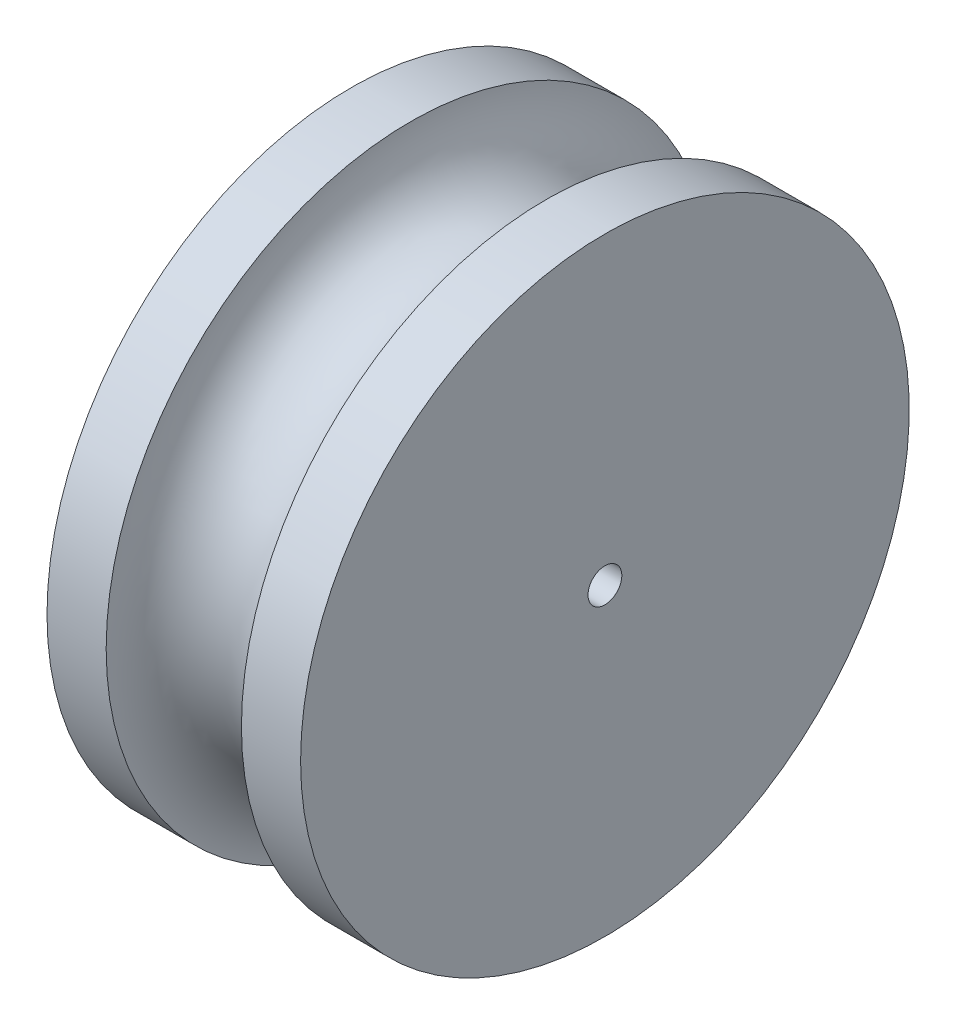
ISO-10303-21;
HEADER;
FILE_DESCRIPTION(('STEP AP214'),'2;1');
FILE_NAME('part.step','',(''),(''),'','','');
FILE_SCHEMA(('AUTOMOTIVE_DESIGN { 1 0 10303 214 1 1 1 1 }'));
ENDSEC;
DATA;
#1=APPLICATION_CONTEXT('core data for automotive mechanical design processes');
#2=APPLICATION_PROTOCOL_DEFINITION('international standard','automotive_design',2000,#1);
#3=PRODUCT_CONTEXT('',#1,'mechanical');
#4=PRODUCT('Part','Part','',(#3));
#5=PRODUCT_RELATED_PRODUCT_CATEGORY('part','',(#4));
#6=PRODUCT_DEFINITION_FORMATION('','',#4);
#7=PRODUCT_DEFINITION_CONTEXT('part definition',#1,'design');
#8=PRODUCT_DEFINITION('design','',#6,#7);
#9=PRODUCT_DEFINITION_SHAPE('','',#8);
#10=(LENGTH_UNIT() NAMED_UNIT(*) SI_UNIT(.MILLI.,.METRE.));
#11=(NAMED_UNIT(*) PLANE_ANGLE_UNIT() SI_UNIT($,.RADIAN.));
#12=(NAMED_UNIT(*) SI_UNIT($,.STERADIAN.) SOLID_ANGLE_UNIT());
#13=UNCERTAINTY_MEASURE_WITH_UNIT(LENGTH_MEASURE(1.E-05),#10,'distance_accuracy_value','');
#14=(GEOMETRIC_REPRESENTATION_CONTEXT(3) GLOBAL_UNCERTAINTY_ASSIGNED_CONTEXT((#13)) GLOBAL_UNIT_ASSIGNED_CONTEXT((#10,
#11,#12)) REPRESENTATION_CONTEXT('',''));
#15=CARTESIAN_POINT('',(0.,0.,0.));
#16=DIRECTION('',(0.,0.,1.));
#17=DIRECTION('',(1.,0.,0.));
#18=AXIS2_PLACEMENT_3D('',#15,#16,#17);
#19=CARTESIAN_POINT('',(-3583.58955329185,0.,0.));
#20=DIRECTION('',(-1.,0.,0.));
#21=DIRECTION('',(0.,0.,1.));
#22=AXIS2_PLACEMENT_3D('',#19,#20,#21);
#23=CYLINDRICAL_SURFACE('',#22,228.6);
#24=CARTESIAN_POINT('',(-95.2500000000001,0.,0.));
#25=DIRECTION('',(-1.,0.,0.));
#26=DIRECTION('',(0.,0.,1.));
#27=AXIS2_PLACEMENT_3D('',#24,#25,#26);
#28=CIRCLE('',#27,228.6);
#29=CARTESIAN_POINT('',(-95.2500000000001,0.,228.6));
#30=VERTEX_POINT('',#29);
#31=EDGE_CURVE('E10',#30,#30,#28,.T.);
#32=ORIENTED_EDGE('',*,*,#31,.F.);
#33=EDGE_LOOP('',(#32));
#34=FACE_BOUND('',#33,.T.);
#35=CARTESIAN_POINT('',(-50.7999999999993,0.,0.));
#36=DIRECTION('',(-1.,0.,0.));
#37=DIRECTION('',(0.,0.,1.));
#38=AXIS2_PLACEMENT_3D('',#35,#36,#37);
#39=CIRCLE('',#38,228.6);
#40=CARTESIAN_POINT('',(-50.7999999999993,0.,228.6));
#41=VERTEX_POINT('',#40);
#42=EDGE_CURVE('E68',#41,#41,#39,.T.);
#43=ORIENTED_EDGE('',*,*,#42,.T.);
#44=EDGE_LOOP('',(#43));
#45=FACE_BOUND('',#44,.T.);
#46=ADVANCED_FACE('F41',(#34,#45),#23,.T.);
#47=CARTESIAN_POINT('',(-95.25,0.,-12.7));
#48=DIRECTION('',(1.,0.,0.));
#49=DIRECTION('',(0.,0.,-1.));
#50=AXIS2_PLACEMENT_3D('',#47,#48,#49);
#51=PLANE('',#50);
#52=CARTESIAN_POINT('',(-95.2500000000001,0.,0.));
#53=DIRECTION('',(-1.,0.,0.));
#54=DIRECTION('',(0.,0.,1.));
#55=AXIS2_PLACEMENT_3D('',#52,#53,#54);
#56=CIRCLE('',#55,12.7);
#57=CARTESIAN_POINT('',(-95.2500000000001,0.,12.7));
#58=VERTEX_POINT('',#57);
#59=EDGE_CURVE('E48',#58,#58,#56,.T.);
#60=ORIENTED_EDGE('',*,*,#59,.F.);
#61=EDGE_LOOP('',(#60));
#62=FACE_BOUND('',#61,.T.);
#63=ORIENTED_EDGE('',*,*,#31,.T.);
#64=EDGE_LOOP('',(#63));
#65=FACE_BOUND('',#64,.T.);
#66=ADVANCED_FACE('F94',(#62,#65),#51,.F.);
#67=CARTESIAN_POINT('',(-3583.58955329185,0.,0.));
#68=DIRECTION('',(-1.,0.,0.));
#69=DIRECTION('',(0.,0.,1.));
#70=AXIS2_PLACEMENT_3D('',#67,#68,#69);
#71=CYLINDRICAL_SURFACE('',#70,12.7);
#72=CARTESIAN_POINT('',(95.2500000000001,0.,0.));
#73=DIRECTION('',(-1.,0.,0.));
#74=DIRECTION('',(0.,0.,1.));
#75=AXIS2_PLACEMENT_3D('',#72,#73,#74);
#76=CIRCLE('',#75,12.7);
#77=CARTESIAN_POINT('',(95.2500000000001,0.,12.7));
#78=VERTEX_POINT('',#77);
#79=EDGE_CURVE('E53',#78,#78,#76,.T.);
#80=ORIENTED_EDGE('',*,*,#79,.F.);
#81=EDGE_LOOP('',(#80));
#82=FACE_BOUND('',#81,.T.);
#83=ORIENTED_EDGE('',*,*,#59,.T.);
#84=EDGE_LOOP('',(#83));
#85=FACE_BOUND('',#84,.T.);
#86=ADVANCED_FACE('F89',(#82,#85),#71,.F.);
#87=CARTESIAN_POINT('',(95.2499999999992,0.,-12.7));
#88=DIRECTION('',(-1.,0.,0.));
#89=DIRECTION('',(0.,0.,1.));
#90=AXIS2_PLACEMENT_3D('',#87,#88,#89);
#91=PLANE('',#90);
#92=CARTESIAN_POINT('',(95.2499999999983,0.,0.));
#93=DIRECTION('',(-1.,0.,0.));
#94=DIRECTION('',(0.,0.,1.));
#95=AXIS2_PLACEMENT_3D('',#92,#93,#94);
#96=CIRCLE('',#95,228.600000000001);
#97=CARTESIAN_POINT('',(95.2499999999983,0.,228.600000000001));
#98=VERTEX_POINT('',#97);
#99=EDGE_CURVE('E58',#98,#98,#96,.T.);
#100=ORIENTED_EDGE('',*,*,#99,.F.);
#101=EDGE_LOOP('',(#100));
#102=FACE_BOUND('',#101,.T.);
#103=ORIENTED_EDGE('',*,*,#79,.T.);
#104=EDGE_LOOP('',(#103));
#105=FACE_BOUND('',#104,.T.);
#106=ADVANCED_FACE('F83',(#102,#105),#91,.F.);
#107=CARTESIAN_POINT('',(-3583.58955329185,0.,0.));
#108=DIRECTION('',(-1.,0.,0.));
#109=DIRECTION('',(0.,0.,1.));
#110=AXIS2_PLACEMENT_3D('',#107,#108,#109);
#111=CYLINDRICAL_SURFACE('',#110,228.6);
#112=CARTESIAN_POINT('',(50.7999999999984,0.,0.));
#113=DIRECTION('',(-1.,0.,0.));
#114=DIRECTION('',(0.,0.,1.));
#115=AXIS2_PLACEMENT_3D('',#112,#113,#114);
#116=CIRCLE('',#115,228.6);
#117=CARTESIAN_POINT('',(50.7999999999984,0.,228.6));
#118=VERTEX_POINT('',#117);
#119=EDGE_CURVE('E64',#118,#118,#116,.T.);
#120=ORIENTED_EDGE('',*,*,#119,.F.);
#121=EDGE_LOOP('',(#120));
#122=FACE_BOUND('',#121,.T.);
#123=ORIENTED_EDGE('',*,*,#99,.T.);
#124=EDGE_LOOP('',(#123));
#125=FACE_BOUND('',#124,.T.);
#126=ADVANCED_FACE('F77',(#122,#125),#111,.T.);
#127=CARTESIAN_POINT('',(0.,0.,0.));
#128=DIRECTION('',(-1.,0.,0.));
#129=DIRECTION('',(0.,0.,1.));
#130=AXIS2_PLACEMENT_3D('',#127,#128,#129);
#131=TOROIDAL_SURFACE('',#130,228.6,50.7999999999992);
#132=ORIENTED_EDGE('',*,*,#42,.F.);
#133=EDGE_LOOP('',(#132));
#134=FACE_BOUND('',#133,.T.);
#135=ORIENTED_EDGE('',*,*,#119,.T.);
#136=EDGE_LOOP('',(#135));
#137=FACE_BOUND('',#136,.T.);
#138=ADVANCED_FACE('F74',(#134,#137),#131,.F.);
#139=CLOSED_SHELL('',(#46,#66,#86,#106,#126,#138));
#140=MANIFOLD_SOLID_BREP('B2',#139);
#141=ADVANCED_BREP_SHAPE_REPRESENTATION('',(#18,#140),#14);
#142=SHAPE_DEFINITION_REPRESENTATION(#9,#141);
ENDSEC;
END-ISO-10303-21;
